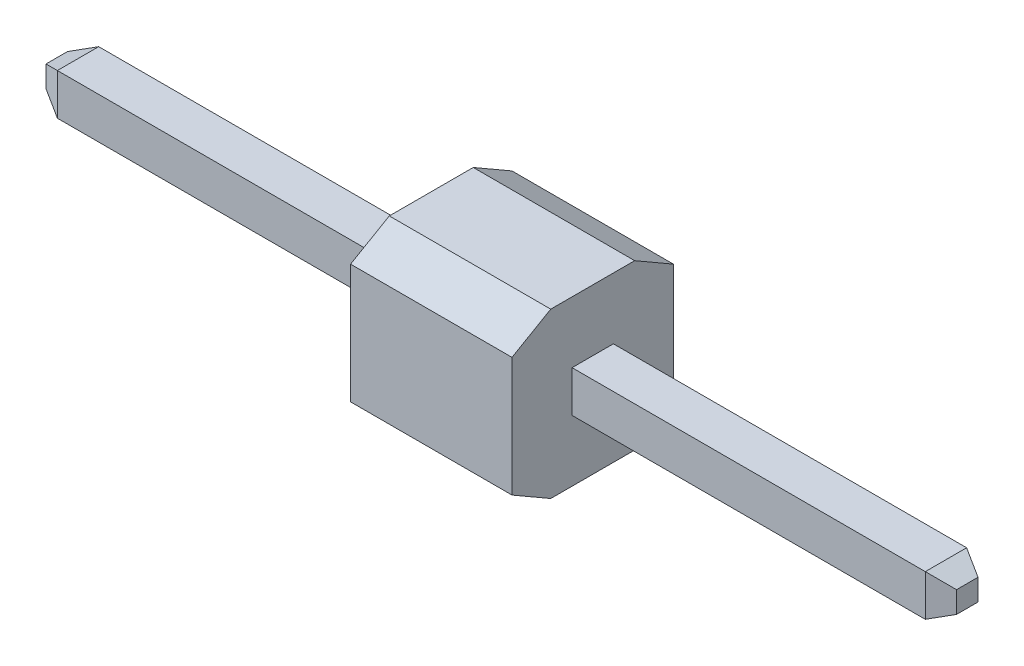
ISO-10303-21;
HEADER;
FILE_DESCRIPTION(('STEP AP214'),'2;1');
FILE_NAME('part.step','',(''),(''),'','','');
FILE_SCHEMA(('AUTOMOTIVE_DESIGN { 1 0 10303 214 1 1 1 1 }'));
ENDSEC;
DATA;
#1=APPLICATION_CONTEXT('core data for automotive mechanical design processes');
#2=APPLICATION_PROTOCOL_DEFINITION('international standard','automotive_design',2000,#1);
#3=PRODUCT_CONTEXT('',#1,'mechanical');
#4=PRODUCT('Part','Part','',(#3));
#5=PRODUCT_RELATED_PRODUCT_CATEGORY('part','',(#4));
#6=PRODUCT_DEFINITION_FORMATION('','',#4);
#7=PRODUCT_DEFINITION_CONTEXT('part definition',#1,'design');
#8=PRODUCT_DEFINITION('design','',#6,#7);
#9=PRODUCT_DEFINITION_SHAPE('','',#8);
#10=(LENGTH_UNIT() NAMED_UNIT(*) SI_UNIT(.MILLI.,.METRE.));
#11=(NAMED_UNIT(*) PLANE_ANGLE_UNIT() SI_UNIT($,.RADIAN.));
#12=(NAMED_UNIT(*) SI_UNIT($,.STERADIAN.) SOLID_ANGLE_UNIT());
#13=UNCERTAINTY_MEASURE_WITH_UNIT(LENGTH_MEASURE(1.E-05),#10,'distance_accuracy_value','');
#14=(GEOMETRIC_REPRESENTATION_CONTEXT(3) GLOBAL_UNCERTAINTY_ASSIGNED_CONTEXT((#13)) GLOBAL_UNIT_ASSIGNED_CONTEXT((#10,
#11,#12)) REPRESENTATION_CONTEXT('',''));
#15=CARTESIAN_POINT('',(0.,0.,0.));
#16=DIRECTION('',(0.,0.,1.));
#17=DIRECTION('',(1.,0.,0.));
#18=AXIS2_PLACEMENT_3D('',#15,#16,#17);
#19=CARTESIAN_POINT('',(5.4210745014383,9.84287173708609,0.629998634255617));
#20=DIRECTION('',(1.,4.37113882867379E-08,-4.37113882867379E-08));
#21=DIRECTION('',(-4.37113882867379E-08,1.,0.));
#22=AXIS2_PLACEMENT_3D('',#19,#20,#21);
#23=PLANE('',#22);
#24=DIRECTION('',(1.59994790123753E-08,0.500000000000192,0.866025403784328));
#25=VECTOR('',#24,1.);
#26=CARTESIAN_POINT('',(5.42107437845239,11.0864615755721,-0.940001365744382));
#27=LINE('',#26,#25);
#28=CARTESIAN_POINT('',(5.42107437845239,11.0864615755721,-0.940001365744382));
#29=VERTEX_POINT('',#28);
#30=CARTESIAN_POINT('',(5.42107438953715,11.4328717370861,-0.340001365744383));
#31=VERTEX_POINT('',#30);
#32=EDGE_CURVE('E11',#29,#31,#27,.T.);
#33=ORIENTED_EDGE('',*,*,#32,.T.);
#34=DIRECTION('',(4.37113886966664E-08,0.,0.999999999999999));
#35=VECTOR('',#34,1.);
#36=CARTESIAN_POINT('',(5.42107438953715,11.4328717370861,-0.340001365744383));
#37=LINE('',#36,#35);
#38=CARTESIAN_POINT('',(5.42107444636195,11.4328717370861,0.959998634255618));
#39=VERTEX_POINT('',#38);
#40=EDGE_CURVE('E304',#31,#39,#37,.T.);
#41=ORIENTED_EDGE('',*,*,#40,.T.);
#42=DIRECTION('',(5.97108656004285E-08,-0.500000000000188,0.866025403784328));
#43=VECTOR('',#42,1.);
#44=CARTESIAN_POINT('',(5.42107444636195,11.4328717370861,0.959998634255618));
#45=LINE('',#44,#43);
#46=CARTESIAN_POINT('',(5.42107448773086,11.0864615755721,1.55999863425562));
#47=VERTEX_POINT('',#46);
#48=EDGE_CURVE('E296',#39,#47,#45,.T.);
#49=ORIENTED_EDGE('',*,*,#48,.T.);
#50=DIRECTION('',(4.37113884815072E-08,-0.999999999999999,0.));
#51=VECTOR('',#50,1.);
#52=CARTESIAN_POINT('',(5.42107448773086,11.0864615755721,1.55999863425562));
#53=LINE('',#52,#51);
#54=CARTESIAN_POINT('',(5.42107456847364,9.23928189860009,1.55999863425562));
#55=VERTEX_POINT('',#54);
#56=EDGE_CURVE('E281',#47,#55,#53,.T.);
#57=ORIENTED_EDGE('',*,*,#56,.T.);
#58=DIRECTION('',(1.59994777304001E-08,0.500000000000192,0.866025403784328));
#59=VECTOR('',#58,1.);
#60=CARTESIAN_POINT('',(5.42107455738888,8.89287173708609,0.959998634255618));
#61=LINE('',#60,#59);
#62=CARTESIAN_POINT('',(5.42107455738888,8.89287173708609,0.959998634255618));
#63=VERTEX_POINT('',#62);
#64=EDGE_CURVE('E265',#63,#55,#61,.T.);
#65=ORIENTED_EDGE('',*,*,#64,.F.);
#66=DIRECTION('',(4.37113886966664E-08,0.,0.999999999999999));
#67=VECTOR('',#66,1.);
#68=CARTESIAN_POINT('',(5.42107450056408,8.89287173708609,-0.340001365744383));
#69=LINE('',#68,#67);
#70=CARTESIAN_POINT('',(5.42107450056408,8.89287173708609,-0.340001365744383));
#71=VERTEX_POINT('',#70);
#72=EDGE_CURVE('E248',#71,#63,#69,.T.);
#73=ORIENTED_EDGE('',*,*,#72,.F.);
#74=DIRECTION('',(5.97108668824036E-08,-0.500000000000188,0.866025403784328));
#75=VECTOR('',#74,1.);
#76=CARTESIAN_POINT('',(5.42107445919517,9.23928189860009,-0.940001365744382));
#77=LINE('',#76,#75);
#78=CARTESIAN_POINT('',(5.42107445919517,9.23928189860009,-0.940001365744382));
#79=VERTEX_POINT('',#78);
#80=EDGE_CURVE('E242',#79,#71,#77,.T.);
#81=ORIENTED_EDGE('',*,*,#80,.F.);
#82=DIRECTION('',(4.37113884815072E-08,-0.999999999999999,0.));
#83=VECTOR('',#82,1.);
#84=CARTESIAN_POINT('',(5.42107437845239,11.0864615755721,-0.940001365744382));
#85=LINE('',#84,#83);
#86=EDGE_CURVE('E236',#29,#79,#85,.T.);
#87=ORIENTED_EDGE('',*,*,#86,.F.);
#88=EDGE_LOOP('',(#33,#41,#49,#57,#65,#73,#81,#87));
#89=FACE_BOUND('',#88,.T.);
#90=DIRECTION('',(-4.37113886753159E-08,0.,-0.999999999999999));
#91=VECTOR('',#90,1.);
#92=CARTESIAN_POINT('',(5.42107447346302,10.4828717370861,0.629998634255617));
#93=LINE('',#92,#91);
#94=CARTESIAN_POINT('',(5.42107447346302,10.4828717370861,0.629998634255617));
#95=VERTEX_POINT('',#94);
#96=CARTESIAN_POINT('',(5.42107444548773,10.4828717370861,-0.0100013657443826));
#97=VERTEX_POINT('',#96);
#98=EDGE_CURVE('E302',#95,#97,#93,.T.);
#99=ORIENTED_EDGE('',*,*,#98,.T.);
#100=DIRECTION('',(-4.3711388675316E-08,0.999999999999999,0.));
#101=VECTOR('',#100,1.);
#102=CARTESIAN_POINT('',(5.42107447346302,9.84287173708609,-0.0100013657443826));
#103=LINE('',#102,#101);
#104=CARTESIAN_POINT('',(5.42107447346302,9.84287173708609,-0.0100013657443826));
#105=VERTEX_POINT('',#104);
#106=EDGE_CURVE('E293',#105,#97,#103,.T.);
#107=ORIENTED_EDGE('',*,*,#106,.F.);
#108=DIRECTION('',(-4.37113886753159E-08,0.,-0.999999999999999));
#109=VECTOR('',#108,1.);
#110=CARTESIAN_POINT('',(5.4210745014383,9.84287173708609,0.629998634255617));
#111=LINE('',#110,#109);
#112=CARTESIAN_POINT('',(5.4210745014383,9.84287173708609,0.629998634255617));
#113=VERTEX_POINT('',#112);
#114=EDGE_CURVE('E278',#113,#105,#111,.T.);
#115=ORIENTED_EDGE('',*,*,#114,.F.);
#116=DIRECTION('',(-4.3711388675316E-08,0.999999999999999,0.));
#117=VECTOR('',#116,1.);
#118=CARTESIAN_POINT('',(5.4210745014383,9.84287173708609,0.629998634255617));
#119=LINE('',#118,#117);
#120=EDGE_CURVE('E263',#113,#95,#119,.T.);
#121=ORIENTED_EDGE('',*,*,#120,.T.);
#122=EDGE_LOOP('',(#99,#107,#115,#121));
#123=FACE_BOUND('',#122,.T.);
#124=ADVANCED_FACE('F17',(#89,#123),#23,.T.);
#125=CARTESIAN_POINT('',(2.9210745014383,9.84287162780762,0.629998743534088));
#126=DIRECTION('',(1.,4.37113882867379E-08,-4.37113882867379E-08));
#127=DIRECTION('',(-4.37113882867379E-08,1.,0.));
#128=AXIS2_PLACEMENT_3D('',#125,#126,#127);
#129=PLANE('',#128);
#130=DIRECTION('',(1.59994783713877E-08,0.500000000000192,0.866025403784328));
#131=VECTOR('',#130,1.);
#132=CARTESIAN_POINT('',(2.92107437845239,11.0864614662936,-0.940001256465912));
#133=LINE('',#132,#131);
#134=CARTESIAN_POINT('',(2.92107437845239,11.0864614662936,-0.940001256465912));
#135=VERTEX_POINT('',#134);
#136=CARTESIAN_POINT('',(2.92107438953715,11.4328716278076,-0.340001256465912));
#137=VERTEX_POINT('',#136);
#138=EDGE_CURVE('E24',#135,#137,#133,.T.);
#139=ORIENTED_EDGE('',*,*,#138,.F.);
#140=DIRECTION('',(4.37113882410924E-08,-0.999999999999999,0.));
#141=VECTOR('',#140,1.);
#142=CARTESIAN_POINT('',(2.92107437845239,11.0864614662936,-0.940001256465912));
#143=LINE('',#142,#141);
#144=CARTESIAN_POINT('',(2.92107445919517,9.23928178932162,-0.940001256465912));
#145=VERTEX_POINT('',#144);
#146=EDGE_CURVE('E300',#135,#145,#143,.T.);
#147=ORIENTED_EDGE('',*,*,#146,.T.);
#148=DIRECTION('',(5.97108668824036E-08,-0.500000000000188,0.866025403784328));
#149=VECTOR('',#148,1.);
#150=CARTESIAN_POINT('',(2.92107445919517,9.23928178932162,-0.940001256465912));
#151=LINE('',#150,#149);
#152=CARTESIAN_POINT('',(2.92107450056408,8.89287162780762,-0.340001256465912));
#153=VERTEX_POINT('',#152);
#154=EDGE_CURVE('E286',#145,#153,#151,.T.);
#155=ORIENTED_EDGE('',*,*,#154,.T.);
#156=DIRECTION('',(4.37113883550593E-08,0.,0.999999999999999));
#157=VECTOR('',#156,1.);
#158=CARTESIAN_POINT('',(2.92107450056408,8.89287162780762,-0.340001256465912));
#159=LINE('',#158,#157);
#160=CARTESIAN_POINT('',(2.92107455738888,8.89287162780762,0.959998743534088));
#161=VERTEX_POINT('',#160);
#162=EDGE_CURVE('E271',#153,#161,#159,.T.);
#163=ORIENTED_EDGE('',*,*,#162,.T.);
#164=DIRECTION('',(1.59994783713877E-08,0.500000000000192,0.866025403784328));
#165=VECTOR('',#164,1.);
#166=CARTESIAN_POINT('',(2.92107455738888,8.89287162780762,0.959998743534088));
#167=LINE('',#166,#165);
#168=CARTESIAN_POINT('',(2.92107456847364,9.23928178932162,1.55999874353409));
#169=VERTEX_POINT('',#168);
#170=EDGE_CURVE('E253',#161,#169,#167,.T.);
#171=ORIENTED_EDGE('',*,*,#170,.T.);
#172=DIRECTION('',(4.37113882410924E-08,-0.999999999999999,0.));
#173=VECTOR('',#172,1.);
#174=CARTESIAN_POINT('',(2.92107448773086,11.0864614662936,1.55999874353409));
#175=LINE('',#174,#173);
#176=CARTESIAN_POINT('',(2.92107448773086,11.0864614662936,1.55999874353409));
#177=VERTEX_POINT('',#176);
#178=EDGE_CURVE('E261',#177,#169,#175,.T.);
#179=ORIENTED_EDGE('',*,*,#178,.F.);
#180=DIRECTION('',(5.97108668824036E-08,-0.500000000000188,0.866025403784328));
#181=VECTOR('',#180,1.);
#182=CARTESIAN_POINT('',(2.92107444636195,11.4328716278076,0.959998743534088));
#183=LINE('',#182,#181);
#184=CARTESIAN_POINT('',(2.92107444636195,11.4328716278076,0.959998743534088));
#185=VERTEX_POINT('',#184);
#186=EDGE_CURVE('E276',#185,#177,#183,.T.);
#187=ORIENTED_EDGE('',*,*,#186,.F.);
#188=DIRECTION('',(4.37113883550593E-08,0.,0.999999999999999));
#189=VECTOR('',#188,1.);
#190=CARTESIAN_POINT('',(2.92107438953715,11.4328716278076,-0.340001256465912));
#191=LINE('',#190,#189);
#192=EDGE_CURVE('E291',#137,#185,#191,.T.);
#193=ORIENTED_EDGE('',*,*,#192,.F.);
#194=EDGE_LOOP('',(#139,#147,#155,#163,#171,#179,#187,#193));
#195=FACE_BOUND('',#194,.T.);
#196=DIRECTION('',(-4.37113879814266E-08,0.999999999999999,0.));
#197=VECTOR('',#196,1.);
#198=CARTESIAN_POINT('',(2.92107447346301,9.84287162780762,-0.0100012564659119));
#199=LINE('',#198,#197);
#200=CARTESIAN_POINT('',(2.92107447346301,9.84287162780762,-0.0100012564659119));
#201=VERTEX_POINT('',#200);
#202=CARTESIAN_POINT('',(2.92107444548773,10.4828716278076,-0.0100012564659119));
#203=VERTEX_POINT('',#202);
#204=EDGE_CURVE('E298',#201,#203,#199,.T.);
#205=ORIENTED_EDGE('',*,*,#204,.T.);
#206=DIRECTION('',(-4.37113879814266E-08,0.,-0.999999999999999));
#207=VECTOR('',#206,1.);
#208=CARTESIAN_POINT('',(2.92107447346301,10.4828716278076,0.629998743534088));
#209=LINE('',#208,#207);
#210=CARTESIAN_POINT('',(2.92107447346301,10.4828716278076,0.629998743534088));
#211=VERTEX_POINT('',#210);
#212=EDGE_CURVE('E283',#211,#203,#209,.T.);
#213=ORIENTED_EDGE('',*,*,#212,.F.);
#214=DIRECTION('',(-4.3711388675316E-08,0.999999999999999,0.));
#215=VECTOR('',#214,1.);
#216=CARTESIAN_POINT('',(2.9210745014383,9.84287162780762,0.629998743534088));
#217=LINE('',#216,#215);
#218=CARTESIAN_POINT('',(2.9210745014383,9.84287162780762,0.629998743534088));
#219=VERTEX_POINT('',#218);
#220=EDGE_CURVE('E268',#219,#211,#217,.T.);
#221=ORIENTED_EDGE('',*,*,#220,.F.);
#222=DIRECTION('',(-4.37113886753159E-08,0.,-0.999999999999999));
#223=VECTOR('',#222,1.);
#224=CARTESIAN_POINT('',(2.9210745014383,9.84287162780762,0.629998743534088));
#225=LINE('',#224,#223);
#226=EDGE_CURVE('E251',#219,#201,#225,.T.);
#227=ORIENTED_EDGE('',*,*,#226,.T.);
#228=EDGE_LOOP('',(#205,#213,#221,#227));
#229=FACE_BOUND('',#228,.T.);
#230=ADVANCED_FACE('F314',(#195,#229),#129,.F.);
#231=CARTESIAN_POINT('',(5.42107437845239,11.0864615755721,-0.940001365744382));
#232=DIRECTION('',(5.97108668343731E-08,-0.866025403784328,0.50000000000019));
#233=DIRECTION('',(-1.59994785476185E-08,-0.500000000000192,-0.866025403784329));
#234=AXIS2_PLACEMENT_3D('',#231,#232,#233);
#235=PLANE('',#234);
#236=ORIENTED_EDGE('',*,*,#138,.T.);
#237=DIRECTION('',(-0.999999999999998,-4.37113889972806E-08,4.37113883755557E-08));
#238=VECTOR('',#237,1.);
#239=CARTESIAN_POINT('',(5.42107438953715,11.4328717370861,-0.340001365744383));
#240=LINE('',#239,#238);
#241=EDGE_CURVE('E288',#31,#137,#240,.T.);
#242=ORIENTED_EDGE('',*,*,#241,.F.);
#243=ORIENTED_EDGE('',*,*,#32,.F.);
#244=DIRECTION('',(-0.999999999999998,-4.37113882867378E-08,4.37113881091022E-08));
#245=VECTOR('',#244,1.);
#246=CARTESIAN_POINT('',(5.42107437845239,11.0864615755721,-0.940001365744382));
#247=LINE('',#246,#245);
#248=EDGE_CURVE('E256',#29,#135,#247,.T.);
#249=ORIENTED_EDGE('',*,*,#248,.T.);
#250=EDGE_LOOP('',(#236,#242,#243,#249));
#251=FACE_BOUND('',#250,.T.);
#252=ADVANCED_FACE('F306',(#251),#235,.F.);
#253=CARTESIAN_POINT('',(5.42107438953715,11.4328717370861,-0.340001365744383));
#254=DIRECTION('',(4.37113882867379E-08,-1.,0.));
#255=DIRECTION('',(1.,4.37113882867379E-08,-4.37113882867379E-08));
#256=AXIS2_PLACEMENT_3D('',#253,#254,#255);
#257=PLANE('',#256);
#258=ORIENTED_EDGE('',*,*,#192,.T.);
#259=DIRECTION('',(-0.999999999999998,-4.37113882867378E-08,4.37113882867378E-08));
#260=VECTOR('',#259,1.);
#261=CARTESIAN_POINT('',(5.42107444636195,11.4328717370861,0.959998634255618));
#262=LINE('',#261,#260);
#263=EDGE_CURVE('E273',#39,#185,#262,.T.);
#264=ORIENTED_EDGE('',*,*,#263,.F.);
#265=ORIENTED_EDGE('',*,*,#40,.F.);
#266=ORIENTED_EDGE('',*,*,#241,.T.);
#267=EDGE_LOOP('',(#258,#264,#265,#266));
#268=FACE_BOUND('',#267,.T.);
#269=ADVANCED_FACE('F311',(#268),#257,.F.);
#270=CARTESIAN_POINT('',(5.42107444636195,11.4328717370861,0.959998634255618));
#271=DIRECTION('',(1.59994785476185E-08,-0.86602540378433,-0.50000000000019));
#272=DIRECTION('',(-5.97108668343731E-08,0.500000000000188,-0.866025403784329));
#273=AXIS2_PLACEMENT_3D('',#270,#271,#272);
#274=PLANE('',#273);
#275=ORIENTED_EDGE('',*,*,#186,.T.);
#276=DIRECTION('',(-0.999999999999998,-4.37113882867378E-08,4.37113882867378E-08));
#277=VECTOR('',#276,1.);
#278=CARTESIAN_POINT('',(5.42107448773086,11.0864615755721,1.55999863425562));
#279=LINE('',#278,#277);
#280=EDGE_CURVE('E258',#47,#177,#279,.T.);
#281=ORIENTED_EDGE('',*,*,#280,.F.);
#282=ORIENTED_EDGE('',*,*,#48,.F.);
#283=ORIENTED_EDGE('',*,*,#263,.T.);
#284=EDGE_LOOP('',(#275,#281,#282,#283));
#285=FACE_BOUND('',#284,.T.);
#286=ADVANCED_FACE('F319',(#285),#274,.F.);
#287=CARTESIAN_POINT('',(5.42107448773086,11.0864615755721,1.55999863425562));
#288=DIRECTION('',(-4.37113882867379E-08,0.,-1.));
#289=DIRECTION('',(-1.,-4.37113882867379E-08,4.37113882867379E-08));
#290=AXIS2_PLACEMENT_3D('',#287,#288,#289);
#291=PLANE('',#290);
#292=ORIENTED_EDGE('',*,*,#178,.T.);
#293=DIRECTION('',(-0.999999999999998,-4.37113889972806E-08,4.37113882867378E-08));
#294=VECTOR('',#293,1.);
#295=CARTESIAN_POINT('',(5.42107456847364,9.23928189860009,1.55999863425562));
#296=LINE('',#295,#294);
#297=EDGE_CURVE('E245',#55,#169,#296,.T.);
#298=ORIENTED_EDGE('',*,*,#297,.F.);
#299=ORIENTED_EDGE('',*,*,#56,.F.);
#300=ORIENTED_EDGE('',*,*,#280,.T.);
#301=EDGE_LOOP('',(#292,#298,#299,#300));
#302=FACE_BOUND('',#301,.T.);
#303=ADVANCED_FACE('F326',(#302),#291,.F.);
#304=CARTESIAN_POINT('',(5.42107455738888,8.89287173708609,0.959998634255618));
#305=DIRECTION('',(5.97108668343731E-08,-0.866025403784328,0.50000000000019));
#306=DIRECTION('',(-1.59994785476185E-08,-0.500000000000192,-0.866025403784329));
#307=AXIS2_PLACEMENT_3D('',#304,#305,#306);
#308=PLANE('',#307);
#309=ORIENTED_EDGE('',*,*,#170,.F.);
#310=DIRECTION('',(-0.999999999999998,-4.37113882867378E-08,4.37113882867378E-08));
#311=VECTOR('',#310,1.);
#312=CARTESIAN_POINT('',(5.42107455738888,8.89287173708609,0.959998634255618));
#313=LINE('',#312,#311);
#314=EDGE_CURVE('E239',#63,#161,#313,.T.);
#315=ORIENTED_EDGE('',*,*,#314,.F.);
#316=ORIENTED_EDGE('',*,*,#64,.T.);
#317=ORIENTED_EDGE('',*,*,#297,.T.);
#318=EDGE_LOOP('',(#309,#315,#316,#317));
#319=FACE_BOUND('',#318,.T.);
#320=ADVANCED_FACE('F329',(#319),#308,.T.);
#321=CARTESIAN_POINT('',(5.42107450056408,8.89287173708609,-0.340001365744383));
#322=DIRECTION('',(4.37113882867379E-08,-1.,0.));
#323=DIRECTION('',(1.,4.37113882867379E-08,-4.37113882867379E-08));
#324=AXIS2_PLACEMENT_3D('',#321,#322,#323);
#325=PLANE('',#324);
#326=ORIENTED_EDGE('',*,*,#162,.F.);
#327=DIRECTION('',(-0.999999999999998,-4.37113882867378E-08,4.37113883755557E-08));
#328=VECTOR('',#327,1.);
#329=CARTESIAN_POINT('',(5.42107450056408,8.89287173708609,-0.340001365744383));
#330=LINE('',#329,#328);
#331=EDGE_CURVE('E233',#71,#153,#330,.T.);
#332=ORIENTED_EDGE('',*,*,#331,.F.);
#333=ORIENTED_EDGE('',*,*,#72,.T.);
#334=ORIENTED_EDGE('',*,*,#314,.T.);
#335=EDGE_LOOP('',(#326,#332,#333,#334));
#336=FACE_BOUND('',#335,.T.);
#337=ADVANCED_FACE('F333',(#336),#325,.T.);
#338=CARTESIAN_POINT('',(5.42107445919517,9.23928189860009,-0.940001365744382));
#339=DIRECTION('',(1.59994785476185E-08,-0.86602540378433,-0.50000000000019));
#340=DIRECTION('',(-5.97108668343731E-08,0.500000000000188,-0.866025403784329));
#341=AXIS2_PLACEMENT_3D('',#338,#339,#340);
#342=PLANE('',#341);
#343=ORIENTED_EDGE('',*,*,#154,.F.);
#344=DIRECTION('',(-0.999999999999998,-4.37113889972806E-08,4.37113881091022E-08));
#345=VECTOR('',#344,1.);
#346=CARTESIAN_POINT('',(5.42107445919517,9.23928189860009,-0.940001365744382));
#347=LINE('',#346,#345);
#348=EDGE_CURVE('E230',#79,#145,#347,.T.);
#349=ORIENTED_EDGE('',*,*,#348,.F.);
#350=ORIENTED_EDGE('',*,*,#80,.T.);
#351=ORIENTED_EDGE('',*,*,#331,.T.);
#352=EDGE_LOOP('',(#343,#349,#350,#351));
#353=FACE_BOUND('',#352,.T.);
#354=ADVANCED_FACE('F337',(#353),#342,.T.);
#355=CARTESIAN_POINT('',(5.42107437845239,11.0864615755721,-0.940001365744382));
#356=DIRECTION('',(-4.37113882867379E-08,0.,-1.));
#357=DIRECTION('',(-4.37113882867379E-08,1.,0.));
#358=AXIS2_PLACEMENT_3D('',#355,#356,#357);
#359=PLANE('',#358);
#360=ORIENTED_EDGE('',*,*,#146,.F.);
#361=ORIENTED_EDGE('',*,*,#248,.F.);
#362=ORIENTED_EDGE('',*,*,#86,.T.);
#363=ORIENTED_EDGE('',*,*,#348,.T.);
#364=EDGE_LOOP('',(#360,#361,#362,#363));
#365=FACE_BOUND('',#364,.T.);
#366=ADVANCED_FACE('F339',(#365),#359,.T.);
#367=CARTESIAN_POINT('',(-2.8789254985617,9.84287137428157,0.62999899706014));
#368=DIRECTION('',(-1.,-4.37113882867379E-08,4.37113882867379E-08));
#369=DIRECTION('',(4.37113882867379E-08,-1.,0.));
#370=AXIS2_PLACEMENT_3D('',#367,#368,#369);
#371=PLANE('',#370);
#372=DIRECTION('',(4.37113874013716E-08,-0.999999999999999,0.));
#373=VECTOR('',#372,1.);
#374=CARTESIAN_POINT('',(-2.87892554105952,10.3289898470906,0.14388052425114));
#375=LINE('',#374,#373);
#376=CARTESIAN_POINT('',(-2.87892554105952,10.3289898470906,0.14388052425114));
#377=VERTEX_POINT('',#376);
#378=CARTESIAN_POINT('',(-2.87892552653699,9.99675290147256,0.14388052425114));
#379=VERTEX_POINT('',#378);
#380=EDGE_CURVE('E228',#377,#379,#375,.T.);
#381=ORIENTED_EDGE('',*,*,#380,.T.);
#382=DIRECTION('',(4.37113900746999E-08,0.,0.999999999999999));
#383=VECTOR('',#382,1.);
#384=CARTESIAN_POINT('',(-2.87892552653699,9.99675290147256,0.14388052425114));
#385=LINE('',#384,#383);
#386=CARTESIAN_POINT('',(-2.87892551201445,9.99675290147256,0.47611746986914));
#387=VERTEX_POINT('',#386);
#388=EDGE_CURVE('E223',#379,#387,#385,.T.);
#389=ORIENTED_EDGE('',*,*,#388,.T.);
#390=DIRECTION('',(-4.37113900746999E-08,0.999999999999999,0.));
#391=VECTOR('',#390,1.);
#392=CARTESIAN_POINT('',(-2.87892551201445,9.99675290147256,0.47611746986914));
#393=LINE('',#392,#391);
#394=CARTESIAN_POINT('',(-2.87892552653699,10.3289898470906,0.47611746986914));
#395=VERTEX_POINT('',#394);
#396=EDGE_CURVE('E215',#387,#395,#393,.T.);
#397=ORIENTED_EDGE('',*,*,#396,.T.);
#398=DIRECTION('',(-4.37113820547151E-08,0.,-0.999999999999999));
#399=VECTOR('',#398,1.);
#400=CARTESIAN_POINT('',(-2.87892552653699,10.3289898470906,0.47611746986914));
#401=LINE('',#400,#399);
#402=EDGE_CURVE('E207',#395,#377,#401,.T.);
#403=ORIENTED_EDGE('',*,*,#402,.T.);
#404=EDGE_LOOP('',(#381,#389,#397,#403));
#405=FACE_BOUND('',#404,.T.);
#406=ADVANCED_FACE('F341',(#405),#371,.T.);
#407=CARTESIAN_POINT('',(-2.8789254985617,9.84287137428157,0.62999899706014));
#408=DIRECTION('',(4.37113882867379E-08,-1.,0.));
#409=DIRECTION('',(-4.37113882867379E-08,0.,-1.));
#410=AXIS2_PLACEMENT_3D('',#407,#408,#409);
#411=PLANE('',#410);
#412=DIRECTION('',(0.999999999999998,4.37113885205545E-08,-4.37113882769955E-08));
#413=VECTOR('',#412,1.);
#414=CARTESIAN_POINT('',(-2.5489254985617,9.84287138870632,0.629998982635382));
#415=LINE('',#414,#413);
#416=CARTESIAN_POINT('',(-2.5489254985617,9.84287138870632,0.629998982635382));
#417=VERTEX_POINT('',#416);
#418=EDGE_CURVE('E225',#417,#219,#415,.T.);
#419=ORIENTED_EDGE('',*,*,#418,.F.);
#420=DIRECTION('',(-4.37113886753159E-08,0.,-0.999999999999999));
#421=VECTOR('',#420,1.);
#422=CARTESIAN_POINT('',(-2.5489254985617,9.84287138870632,0.629998982635382));
#423=LINE('',#422,#421);
#424=CARTESIAN_POINT('',(-2.54892552653699,9.84287138870632,-0.010001017364618));
#425=VERTEX_POINT('',#424);
#426=EDGE_CURVE('E217',#417,#425,#423,.T.);
#427=ORIENTED_EDGE('',*,*,#426,.T.);
#428=DIRECTION('',(0.999999999999998,4.37113885205545E-08,-4.37113882161057E-08));
#429=VECTOR('',#428,1.);
#430=CARTESIAN_POINT('',(-2.54892552653699,9.84287138870632,-0.010001017364618));
#431=LINE('',#430,#429);
#432=EDGE_CURVE('E220',#425,#201,#431,.T.);
#433=ORIENTED_EDGE('',*,*,#432,.T.);
#434=ORIENTED_EDGE('',*,*,#226,.F.);
#435=EDGE_LOOP('',(#419,#427,#433,#434));
#436=FACE_BOUND('',#435,.T.);
#437=ADVANCED_FACE('F348',(#436),#411,.T.);
#438=CARTESIAN_POINT('',(-2.87892552653699,9.84287137428157,-0.0100010029398598));
#439=DIRECTION('',(-4.37113882867379E-08,0.,-1.));
#440=DIRECTION('',(-1.,-4.37113882867379E-08,4.37113882867379E-08));
#441=AXIS2_PLACEMENT_3D('',#438,#439,#440);
#442=PLANE('',#441);
#443=ORIENTED_EDGE('',*,*,#432,.F.);
#444=DIRECTION('',(-4.37113886753159E-08,0.999999999999999,0.));
#445=VECTOR('',#444,1.);
#446=CARTESIAN_POINT('',(-2.54892552653699,9.84287138870632,-0.010001017364618));
#447=LINE('',#446,#445);
#448=CARTESIAN_POINT('',(-2.54892555451227,10.4828713887063,-0.010001017364618));
#449=VERTEX_POINT('',#448);
#450=EDGE_CURVE('E209',#425,#449,#447,.T.);
#451=ORIENTED_EDGE('',*,*,#450,.T.);
#452=DIRECTION('',(0.999999999999998,4.37113881958092E-08,-4.37113882161057E-08));
#453=VECTOR('',#452,1.);
#454=CARTESIAN_POINT('',(-2.54892555451227,10.4828713887063,-0.010001017364618));
#455=LINE('',#454,#453);
#456=EDGE_CURVE('E212',#449,#203,#455,.T.);
#457=ORIENTED_EDGE('',*,*,#456,.T.);
#458=ORIENTED_EDGE('',*,*,#204,.F.);
#459=EDGE_LOOP('',(#443,#451,#457,#458));
#460=FACE_BOUND('',#459,.T.);
#461=ADVANCED_FACE('F424',(#460),#442,.T.);
#462=CARTESIAN_POINT('',(-2.87892552653699,10.4828713742816,0.62999899706014));
#463=DIRECTION('',(4.37113882867379E-08,-1.,0.));
#464=DIRECTION('',(-4.37113882867379E-08,0.,-1.));
#465=AXIS2_PLACEMENT_3D('',#462,#463,#464);
#466=PLANE('',#465);
#467=ORIENTED_EDGE('',*,*,#456,.F.);
#468=DIRECTION('',(4.37113900630947E-08,0.,0.999999999999999));
#469=VECTOR('',#468,1.);
#470=CARTESIAN_POINT('',(-2.54892555451228,10.4828713887063,-0.010001017364618));
#471=LINE('',#470,#469);
#472=CARTESIAN_POINT('',(-2.54892552653699,10.4828713887063,0.629998982635382));
#473=VERTEX_POINT('',#472);
#474=EDGE_CURVE('E201',#449,#473,#471,.T.);
#475=ORIENTED_EDGE('',*,*,#474,.T.);
#476=DIRECTION('',(0.999999999999998,4.37113881958092E-08,-4.37113882769955E-08));
#477=VECTOR('',#476,1.);
#478=CARTESIAN_POINT('',(-2.54892552653699,10.4828713887063,0.629998982635382));
#479=LINE('',#478,#477);
#480=EDGE_CURVE('E204',#473,#211,#479,.T.);
#481=ORIENTED_EDGE('',*,*,#480,.T.);
#482=ORIENTED_EDGE('',*,*,#212,.T.);
#483=EDGE_LOOP('',(#467,#475,#481,#482));
#484=FACE_BOUND('',#483,.T.);
#485=ADVANCED_FACE('F421',(#484),#466,.F.);
#486=CARTESIAN_POINT('',(-2.8789254985617,9.84287137428157,0.62999899706014));
#487=DIRECTION('',(-4.37113882867379E-08,0.,-1.));
#488=DIRECTION('',(-1.,-4.37113882867379E-08,4.37113882867379E-08));
#489=AXIS2_PLACEMENT_3D('',#486,#487,#488);
#490=PLANE('',#489);
#491=ORIENTED_EDGE('',*,*,#480,.F.);
#492=DIRECTION('',(4.37113900630947E-08,-0.999999999999999,0.));
#493=VECTOR('',#492,1.);
#494=CARTESIAN_POINT('',(-2.54892552653699,10.4828713887063,0.629998982635382));
#495=LINE('',#494,#493);
#496=EDGE_CURVE('E196',#473,#417,#495,.T.);
#497=ORIENTED_EDGE('',*,*,#496,.T.);
#498=ORIENTED_EDGE('',*,*,#418,.T.);
#499=ORIENTED_EDGE('',*,*,#220,.T.);
#500=EDGE_LOOP('',(#491,#497,#498,#499));
#501=FACE_BOUND('',#500,.T.);
#502=ADVANCED_FACE('F376',(#501),#490,.F.);
#503=CARTESIAN_POINT('',(-2.8789254985617,9.84287137428157,0.62999899706014));
#504=DIRECTION('',(-4.37113882867379E-08,0.,-1.));
#505=DIRECTION('',(-1.,-4.37113882867379E-08,4.37113882867379E-08));
#506=AXIS2_PLACEMENT_3D('',#503,#504,#505);
#507=PLANE('',#506);
#508=DIRECTION('',(0.999999999999998,4.37113881958092E-08,-4.37113882769955E-08));
#509=VECTOR('',#508,1.);
#510=CARTESIAN_POINT('',(5.4210745014383,9.84287173708609,0.629998634255617));
#511=LINE('',#510,#509);
#512=CARTESIAN_POINT('',(10.8910745014383,9.84287197618738,0.629998395154324));
#513=VERTEX_POINT('',#512);
#514=EDGE_CURVE('E199',#113,#513,#511,.T.);
#515=ORIENTED_EDGE('',*,*,#514,.T.);
#516=DIRECTION('',(-4.37113900630947E-08,0.999999999999999,0.));
#517=VECTOR('',#516,1.);
#518=CARTESIAN_POINT('',(10.8910745014383,9.84287197618738,0.629998395154324));
#519=LINE('',#518,#517);
#520=CARTESIAN_POINT('',(10.891074473463,10.4828719761874,0.629998395154324));
#521=VERTEX_POINT('',#520);
#522=EDGE_CURVE('E191',#513,#521,#519,.T.);
#523=ORIENTED_EDGE('',*,*,#522,.T.);
#524=DIRECTION('',(0.999999999999998,4.37113885205545E-08,-4.37113882769955E-08));
#525=VECTOR('',#524,1.);
#526=CARTESIAN_POINT('',(5.42107447346302,10.4828717370861,0.629998634255617));
#527=LINE('',#526,#525);
#528=EDGE_CURVE('E194',#95,#521,#527,.T.);
#529=ORIENTED_EDGE('',*,*,#528,.F.);
#530=ORIENTED_EDGE('',*,*,#120,.F.);
#531=EDGE_LOOP('',(#515,#523,#529,#530));
#532=FACE_BOUND('',#531,.T.);
#533=ADVANCED_FACE('F367',(#532),#507,.F.);
#534=CARTESIAN_POINT('',(-2.87892552653699,10.4828713742816,0.62999899706014));
#535=DIRECTION('',(4.37113882867379E-08,-1.,0.));
#536=DIRECTION('',(-4.37113882867379E-08,0.,-1.));
#537=AXIS2_PLACEMENT_3D('',#534,#535,#536);
#538=PLANE('',#537);
#539=ORIENTED_EDGE('',*,*,#528,.T.);
#540=DIRECTION('',(-4.37113900630947E-08,0.,-0.999999999999999));
#541=VECTOR('',#540,1.);
#542=CARTESIAN_POINT('',(10.891074473463,10.4828719761874,0.629998395154324));
#543=LINE('',#542,#541);
#544=CARTESIAN_POINT('',(10.8910744454877,10.4828719761874,-0.0100016048456765));
#545=VERTEX_POINT('',#544);
#546=EDGE_CURVE('E186',#521,#545,#543,.T.);
#547=ORIENTED_EDGE('',*,*,#546,.T.);
#548=DIRECTION('',(0.999999999999998,4.37113888452998E-08,-4.37113881146228E-08));
#549=VECTOR('',#548,1.);
#550=CARTESIAN_POINT('',(5.42107444548773,10.4828717370861,-0.0100013657443823));
#551=LINE('',#550,#549);
#552=EDGE_CURVE('E189',#97,#545,#551,.T.);
#553=ORIENTED_EDGE('',*,*,#552,.F.);
#554=ORIENTED_EDGE('',*,*,#98,.F.);
#555=EDGE_LOOP('',(#539,#547,#553,#554));
#556=FACE_BOUND('',#555,.T.);
#557=ADVANCED_FACE('F364',(#556),#538,.F.);
#558=CARTESIAN_POINT('',(-2.87892552653699,9.84287137428157,-0.0100010029398598));
#559=DIRECTION('',(-4.37113882867379E-08,0.,-1.));
#560=DIRECTION('',(-1.,-4.37113882867379E-08,4.37113882867379E-08));
#561=AXIS2_PLACEMENT_3D('',#558,#559,#560);
#562=PLANE('',#561);
#563=ORIENTED_EDGE('',*,*,#552,.T.);
#564=DIRECTION('',(4.37113900630947E-08,-0.999999999999999,0.));
#565=VECTOR('',#564,1.);
#566=CARTESIAN_POINT('',(10.8910744454877,10.4828719761874,-0.0100016048456765));
#567=LINE('',#566,#565);
#568=CARTESIAN_POINT('',(10.891074473463,9.84287197618738,-0.0100016048456765));
#569=VERTEX_POINT('',#568);
#570=EDGE_CURVE('E176',#545,#569,#567,.T.);
#571=ORIENTED_EDGE('',*,*,#570,.T.);
#572=DIRECTION('',(0.999999999999998,4.37113885205545E-08,-4.37113881146228E-08));
#573=VECTOR('',#572,1.);
#574=CARTESIAN_POINT('',(5.42107447346302,9.84287173708609,-0.0100013657443823));
#575=LINE('',#574,#573);
#576=EDGE_CURVE('E179',#105,#569,#575,.T.);
#577=ORIENTED_EDGE('',*,*,#576,.F.);
#578=ORIENTED_EDGE('',*,*,#106,.T.);
#579=EDGE_LOOP('',(#563,#571,#577,#578));
#580=FACE_BOUND('',#579,.T.);
#581=ADVANCED_FACE('F366',(#580),#562,.T.);
#582=CARTESIAN_POINT('',(-2.8789254985617,9.84287137428157,0.62999899706014));
#583=DIRECTION('',(4.37113882867379E-08,-1.,0.));
#584=DIRECTION('',(-4.37113882867379E-08,0.,-1.));
#585=AXIS2_PLACEMENT_3D('',#582,#583,#584);
#586=PLANE('',#585);
#587=ORIENTED_EDGE('',*,*,#576,.T.);
#588=DIRECTION('',(4.37113900630947E-08,0.,0.999999999999999));
#589=VECTOR('',#588,1.);
#590=CARTESIAN_POINT('',(10.891074473463,9.84287197618738,-0.0100016048456765));
#591=LINE('',#590,#589);
#592=EDGE_CURVE('E167',#569,#513,#591,.T.);
#593=ORIENTED_EDGE('',*,*,#592,.T.);
#594=ORIENTED_EDGE('',*,*,#514,.F.);
#595=ORIENTED_EDGE('',*,*,#114,.T.);
#596=EDGE_LOOP('',(#587,#593,#594,#595));
#597=FACE_BOUND('',#596,.T.);
#598=ADVANCED_FACE('F373',(#597),#586,.T.);
#599=CARTESIAN_POINT('',(11.2210745014383,9.84287199061214,0.629998380729565));
#600=DIRECTION('',(-1.,-4.37113882867379E-08,4.37113882867379E-08));
#601=DIRECTION('',(4.37113882867379E-08,-1.,0.));
#602=AXIS2_PLACEMENT_3D('',#599,#600,#601);
#603=PLANE('',#602);
#604=DIRECTION('',(-4.37113927480282E-08,0.999999999999999,0.));
#605=VECTOR('',#604,1.);
#606=CARTESIAN_POINT('',(11.221074473463,9.99675351780314,0.143879907920565));
#607=LINE('',#606,#605);
#608=CARTESIAN_POINT('',(11.221074473463,9.99675351780314,0.143879907920565));
#609=VERTEX_POINT('',#608);
#610=CARTESIAN_POINT('',(11.2210744589405,10.3289904634211,0.143879907920565));
#611=VERTEX_POINT('',#610);
#612=EDGE_CURVE('E153',#609,#611,#607,.T.);
#613=ORIENTED_EDGE('',*,*,#612,.T.);
#614=DIRECTION('',(4.37113927480282E-08,0.,0.999999999999999));
#615=VECTOR('',#614,1.);
#616=CARTESIAN_POINT('',(11.2210744589405,10.3289904634211,0.143879907920565));
#617=LINE('',#616,#615);
#618=CARTESIAN_POINT('',(11.221074473463,10.3289904634211,0.476116853538565));
#619=VERTEX_POINT('',#618);
#620=EDGE_CURVE('E395',#611,#619,#617,.T.);
#621=ORIENTED_EDGE('',*,*,#620,.T.);
#622=DIRECTION('',(4.37113874013716E-08,-0.999999999999999,0.));
#623=VECTOR('',#622,1.);
#624=CARTESIAN_POINT('',(11.221074473463,10.3289904634211,0.476116853538565));
#625=LINE('',#624,#623);
#626=CARTESIAN_POINT('',(11.2210744879856,9.99675351780314,0.476116853538565));
#627=VERTEX_POINT('',#626);
#628=EDGE_CURVE('E156',#619,#627,#625,.T.);
#629=ORIENTED_EDGE('',*,*,#628,.T.);
#630=DIRECTION('',(-4.37113927480282E-08,0.,-0.999999999999999));
#631=VECTOR('',#630,1.);
#632=CARTESIAN_POINT('',(11.2210744879856,9.99675351780314,0.476116853538565));
#633=LINE('',#632,#631);
#634=EDGE_CURVE('E149',#627,#609,#633,.T.);
#635=ORIENTED_EDGE('',*,*,#634,.T.);
#636=EDGE_LOOP('',(#613,#621,#629,#635));
#637=FACE_BOUND('',#636,.T.);
#638=ADVANCED_FACE('F151',(#637),#603,.F.);
#639=CARTESIAN_POINT('',(-2.87892551981061,10.3289898470906,0.62999899706014));
#640=DIRECTION('',(-0.422618301356784,0.906307768563367,1.84732310895534E-08));
#641=DIRECTION('',(4.37113882867379E-08,0.,1.));
#642=AXIS2_PLACEMENT_3D('',#639,#640,#641);
#643=PLANE('',#642);
#644=DIRECTION('',(0.834817095446927,0.389281657126016,-0.389281657126019));
#645=VECTOR('',#644,1.);
#646=CARTESIAN_POINT('',(-2.87892554105921,10.3289898470902,0.143880524251471));
#647=LINE('',#646,#645);
#648=EDGE_CURVE('E181',#377,#449,#647,.T.);
#649=ORIENTED_EDGE('',*,*,#648,.F.);
#650=ORIENTED_EDGE('',*,*,#402,.F.);
#651=DIRECTION('',(-0.834817129479006,-0.38928165712602,-0.389281584143987));
#652=VECTOR('',#651,1.);
#653=CARTESIAN_POINT('',(-2.54892552653677,10.4828713887061,0.629998982635147));
#654=LINE('',#653,#652);
#655=EDGE_CURVE('E404',#473,#395,#654,.T.);
#656=ORIENTED_EDGE('',*,*,#655,.F.);
#657=ORIENTED_EDGE('',*,*,#474,.F.);
#658=EDGE_LOOP('',(#649,#650,#656,#657));
#659=FACE_BOUND('',#658,.T.);
#660=ADVANCED_FACE('F418',(#659),#643,.T.);
#661=CARTESIAN_POINT('',(-2.87892550528807,9.84287137428157,0.47611746986914));
#662=DIRECTION('',(-0.422618222124841,-1.84732292043498E-08,0.906307805509828));
#663=DIRECTION('',(4.37113882867379E-08,-1.,0.));
#664=AXIS2_PLACEMENT_3D('',#661,#662,#663);
#665=PLANE('',#664);
#666=ORIENTED_EDGE('',*,*,#655,.T.);
#667=ORIENTED_EDGE('',*,*,#396,.F.);
#668=DIRECTION('',(-0.834817163511086,0.389281584143988,-0.389281584143987));
#669=VECTOR('',#668,1.);
#670=CARTESIAN_POINT('',(-2.54892549856153,9.84287138870651,0.629998982635199));
#671=LINE('',#670,#669);
#672=EDGE_CURVE('E160',#417,#387,#671,.T.);
#673=ORIENTED_EDGE('',*,*,#672,.F.);
#674=ORIENTED_EDGE('',*,*,#496,.F.);
#675=EDGE_LOOP('',(#666,#667,#673,#674));
#676=FACE_BOUND('',#675,.T.);
#677=ADVANCED_FACE('F434',(#676),#665,.T.);
#678=CARTESIAN_POINT('',(-2.54892552653699,9.84287138870632,-0.010001017364618));
#679=DIRECTION('',(0.422618301356784,1.8473232667688E-08,0.906307768563367));
#680=DIRECTION('',(-4.37113882867379E-08,1.,0.));
#681=AXIS2_PLACEMENT_3D('',#678,#679,#680);
#682=PLANE('',#681);
#683=ORIENTED_EDGE('',*,*,#648,.T.);
#684=ORIENTED_EDGE('',*,*,#450,.F.);
#685=DIRECTION('',(0.834817129479005,-0.389281584143991,-0.389281657126017));
#686=VECTOR('',#685,1.);
#687=CARTESIAN_POINT('',(-2.8789255265369,9.99675290147266,0.143880524251236));
#688=LINE('',#687,#686);
#689=EDGE_CURVE('E170',#379,#425,#688,.T.);
#690=ORIENTED_EDGE('',*,*,#689,.F.);
#691=ORIENTED_EDGE('',*,*,#380,.F.);
#692=EDGE_LOOP('',(#683,#684,#690,#691));
#693=FACE_BOUND('',#692,.T.);
#694=ADVANCED_FACE('F413',(#693),#682,.F.);
#695=CARTESIAN_POINT('',(-2.5489254985617,9.84287138870632,0.629998982635382));
#696=DIRECTION('',(0.422618222124841,0.906307805509828,-1.84732308250282E-08));
#697=DIRECTION('',(-4.37113882867379E-08,0.,-1.));
#698=AXIS2_PLACEMENT_3D('',#695,#696,#697);
#699=PLANE('',#698);
#700=ORIENTED_EDGE('',*,*,#672,.T.);
#701=ORIENTED_EDGE('',*,*,#388,.F.);
#702=ORIENTED_EDGE('',*,*,#689,.T.);
#703=ORIENTED_EDGE('',*,*,#426,.F.);
#704=EDGE_LOOP('',(#700,#701,#702,#703));
#705=FACE_BOUND('',#704,.T.);
#706=ADVANCED_FACE('F429',(#705),#699,.F.);
#707=CARTESIAN_POINT('',(11.2210744947119,9.99675351780314,0.629998380729565));
#708=DIRECTION('',(0.422618301356784,-0.906307768563367,-1.84732310470096E-08));
#709=DIRECTION('',(4.37113882867379E-08,0.,1.));
#710=AXIS2_PLACEMENT_3D('',#707,#708,#709);
#711=PLANE('',#710);
#712=DIRECTION('',(-0.834817129479009,-0.389281657126014,-0.389281584143986));
#713=VECTOR('',#712,1.);
#714=CARTESIAN_POINT('',(11.2210744734627,9.99675351780347,0.143879907920896));
#715=LINE('',#714,#713);
#716=EDGE_CURVE('E164',#609,#569,#715,.T.);
#717=ORIENTED_EDGE('',*,*,#716,.F.);
#718=ORIENTED_EDGE('',*,*,#634,.F.);
#719=DIRECTION('',(0.834817095446927,0.389281657126015,-0.389281657126019));
#720=VECTOR('',#719,1.);
#721=CARTESIAN_POINT('',(10.8910745014383,9.84287197618738,0.629998395154324));
#722=LINE('',#721,#720);
#723=EDGE_CURVE('E392',#513,#627,#722,.T.);
#724=ORIENTED_EDGE('',*,*,#723,.F.);
#725=ORIENTED_EDGE('',*,*,#592,.F.);
#726=EDGE_LOOP('',(#717,#718,#724,#725));
#727=FACE_BOUND('',#726,.T.);
#728=ADVANCED_FACE('F165',(#727),#711,.T.);
#729=CARTESIAN_POINT('',(10.8910745014383,9.84287197618738,0.629998395154324));
#730=DIRECTION('',(-0.422618301356784,-1.8473232667688E-08,-0.906307768563367));
#731=DIRECTION('',(-4.37113882867379E-08,1.,0.));
#732=AXIS2_PLACEMENT_3D('',#729,#730,#731);
#733=PLANE('',#732);
#734=ORIENTED_EDGE('',*,*,#723,.T.);
#735=ORIENTED_EDGE('',*,*,#628,.F.);
#736=DIRECTION('',(0.834817129479006,-0.389281584143988,-0.389281657126019));
#737=VECTOR('',#736,1.);
#738=CARTESIAN_POINT('',(10.8910744734629,10.4828719761873,0.629998395154179));
#739=LINE('',#738,#737);
#740=EDGE_CURVE('E389',#521,#619,#739,.T.);
#741=ORIENTED_EDGE('',*,*,#740,.F.);
#742=ORIENTED_EDGE('',*,*,#522,.F.);
#743=EDGE_LOOP('',(#734,#735,#741,#742));
#744=FACE_BOUND('',#743,.T.);
#745=ADVANCED_FACE('F390',(#744),#733,.F.);
#746=CARTESIAN_POINT('',(11.2210744801894,9.84287199061214,0.143879907920565));
#747=DIRECTION('',(0.422618222124841,1.84732292043498E-08,-0.906307805509828));
#748=DIRECTION('',(4.37113882867379E-08,-1.,0.));
#749=AXIS2_PLACEMENT_3D('',#746,#747,#748);
#750=PLANE('',#749);
#751=ORIENTED_EDGE('',*,*,#716,.T.);
#752=ORIENTED_EDGE('',*,*,#570,.F.);
#753=DIRECTION('',(-0.834817163511087,0.389281584143984,-0.389281584143988));
#754=VECTOR('',#753,1.);
#755=CARTESIAN_POINT('',(11.2210744589402,10.3289904634208,0.143879907920896));
#756=LINE('',#755,#754);
#757=EDGE_CURVE('E175',#611,#545,#756,.T.);
#758=ORIENTED_EDGE('',*,*,#757,.F.);
#759=ORIENTED_EDGE('',*,*,#612,.F.);
#760=EDGE_LOOP('',(#751,#752,#758,#759));
#761=FACE_BOUND('',#760,.T.);
#762=ADVANCED_FACE('F173',(#761),#750,.T.);
#763=CARTESIAN_POINT('',(10.891074473463,10.4828719761874,0.629998395154324));
#764=DIRECTION('',(-0.422618222124841,-0.906307805509828,1.84732307824844E-08));
#765=DIRECTION('',(-4.37113882867379E-08,0.,-1.));
#766=AXIS2_PLACEMENT_3D('',#763,#764,#765);
#767=PLANE('',#766);
#768=ORIENTED_EDGE('',*,*,#740,.T.);
#769=ORIENTED_EDGE('',*,*,#620,.F.);
#770=ORIENTED_EDGE('',*,*,#757,.T.);
#771=ORIENTED_EDGE('',*,*,#546,.F.);
#772=EDGE_LOOP('',(#768,#769,#770,#771));
#773=FACE_BOUND('',#772,.T.);
#774=ADVANCED_FACE('F394',(#773),#767,.F.);
#775=CLOSED_SHELL('',(#124,#230,#252,#269,#286,#303,#320,#337,#354,#366,#406,#437,#461,#485,
#502,#533,#557,#581,#598,#638,#660,#677,#694,#706,#728,#745,#762,#774));
#776=MANIFOLD_SOLID_BREP('B1',#775);
#777=ADVANCED_BREP_SHAPE_REPRESENTATION('',(#18,#776),#14);
#778=SHAPE_DEFINITION_REPRESENTATION(#9,#777);
ENDSEC;
END-ISO-10303-21;
